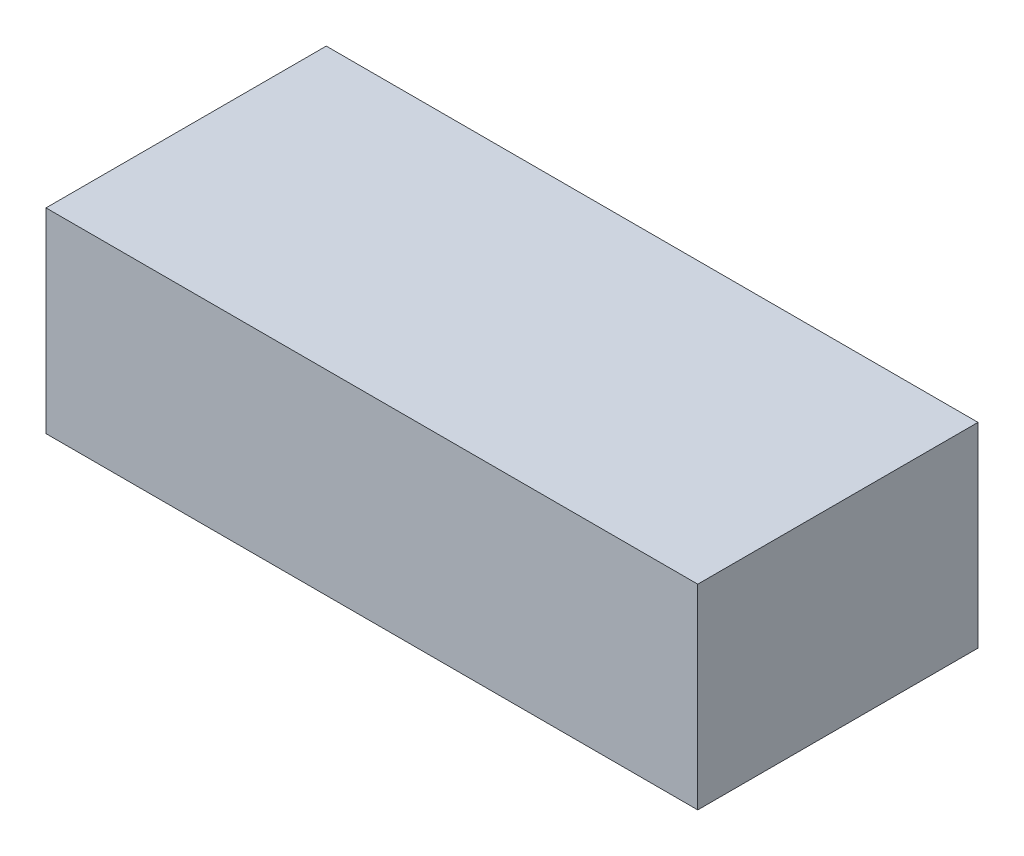
ISO-10303-21;
HEADER;
FILE_DESCRIPTION(('STEP AP214'),'2;1');
FILE_NAME('part.step','',(''),(''),'','','');
FILE_SCHEMA(('AUTOMOTIVE_DESIGN { 1 0 10303 214 1 1 1 1 }'));
ENDSEC;
DATA;
#1=APPLICATION_CONTEXT('core data for automotive mechanical design processes');
#2=APPLICATION_PROTOCOL_DEFINITION('international standard','automotive_design',2000,#1);
#3=PRODUCT_CONTEXT('',#1,'mechanical');
#4=PRODUCT('Part','Part','',(#3));
#5=PRODUCT_RELATED_PRODUCT_CATEGORY('part','',(#4));
#6=PRODUCT_DEFINITION_FORMATION('','',#4);
#7=PRODUCT_DEFINITION_CONTEXT('part definition',#1,'design');
#8=PRODUCT_DEFINITION('design','',#6,#7);
#9=PRODUCT_DEFINITION_SHAPE('','',#8);
#10=(LENGTH_UNIT() NAMED_UNIT(*) SI_UNIT(.MILLI.,.METRE.));
#11=(NAMED_UNIT(*) PLANE_ANGLE_UNIT() SI_UNIT($,.RADIAN.));
#12=(NAMED_UNIT(*) SI_UNIT($,.STERADIAN.) SOLID_ANGLE_UNIT());
#13=UNCERTAINTY_MEASURE_WITH_UNIT(LENGTH_MEASURE(1.E-05),#10,'distance_accuracy_value','');
#14=(GEOMETRIC_REPRESENTATION_CONTEXT(3) GLOBAL_UNCERTAINTY_ASSIGNED_CONTEXT((#13)) GLOBAL_UNIT_ASSIGNED_CONTEXT((#10,
#11,#12)) REPRESENTATION_CONTEXT('',''));
#15=CARTESIAN_POINT('',(0.,0.,0.));
#16=DIRECTION('',(0.,0.,1.));
#17=DIRECTION('',(1.,0.,0.));
#18=AXIS2_PLACEMENT_3D('',#15,#16,#17);
#19=CARTESIAN_POINT('',(-1.27,0.381,0.));
#20=DIRECTION('',(0.,1.,0.));
#21=DIRECTION('',(0.,0.,1.));
#22=AXIS2_PLACEMENT_3D('',#19,#20,#21);
#23=PLANE('',#22);
#24=DIRECTION('',(0.,0.,-1.));
#25=VECTOR('',#24,1.);
#26=CARTESIAN_POINT('',(1.27,0.381,0.));
#27=LINE('',#26,#25);
#28=CARTESIAN_POINT('',(1.27,0.381,0.));
#29=VERTEX_POINT('',#28);
#30=CARTESIAN_POINT('',(1.27,0.381,1.0922));
#31=VERTEX_POINT('',#30);
#32=EDGE_CURVE('E19',#29,#31,#27,.F.);
#33=ORIENTED_EDGE('',*,*,#32,.F.);
#34=DIRECTION('',(1.,0.,0.));
#35=VECTOR('',#34,1.);
#36=CARTESIAN_POINT('',(1.27,0.381,0.));
#37=LINE('',#36,#35);
#38=CARTESIAN_POINT('',(-1.27,0.381,0.));
#39=VERTEX_POINT('',#38);
#40=EDGE_CURVE('E79',#29,#39,#37,.F.);
#41=ORIENTED_EDGE('',*,*,#40,.T.);
#42=DIRECTION('',(0.,0.,1.));
#43=VECTOR('',#42,1.);
#44=CARTESIAN_POINT('',(-1.27,0.381,0.));
#45=LINE('',#44,#43);
#46=CARTESIAN_POINT('',(-1.27,0.381,1.0922));
#47=VERTEX_POINT('',#46);
#48=EDGE_CURVE('E67',#47,#39,#45,.F.);
#49=ORIENTED_EDGE('',*,*,#48,.F.);
#50=DIRECTION('',(1.,0.,0.));
#51=VECTOR('',#50,1.);
#52=CARTESIAN_POINT('',(1.27,0.381,1.0922));
#53=LINE('',#52,#51);
#54=EDGE_CURVE('E55',#31,#47,#53,.F.);
#55=ORIENTED_EDGE('',*,*,#54,.F.);
#56=EDGE_LOOP('',(#33,#41,#49,#55));
#57=FACE_BOUND('',#56,.T.);
#58=ADVANCED_FACE('F16',(#57),#23,.T.);
#59=CARTESIAN_POINT('',(1.27,0.381,0.));
#60=DIRECTION('',(1.,0.,0.));
#61=DIRECTION('',(0.,0.,-1.));
#62=AXIS2_PLACEMENT_3D('',#59,#60,#61);
#63=PLANE('',#62);
#64=DIRECTION('',(0.,0.,-1.));
#65=VECTOR('',#64,1.);
#66=CARTESIAN_POINT('',(1.27,-0.381,0.));
#67=LINE('',#66,#65);
#68=CARTESIAN_POINT('',(1.27,-0.381,0.));
#69=VERTEX_POINT('',#68);
#70=CARTESIAN_POINT('',(1.27,-0.381,1.0922));
#71=VERTEX_POINT('',#70);
#72=EDGE_CURVE('E82',#69,#71,#67,.F.);
#73=ORIENTED_EDGE('',*,*,#72,.F.);
#74=DIRECTION('',(0.,1.,0.));
#75=VECTOR('',#74,1.);
#76=CARTESIAN_POINT('',(1.27,-0.381,0.));
#77=LINE('',#76,#75);
#78=EDGE_CURVE('E64',#69,#29,#77,.T.);
#79=ORIENTED_EDGE('',*,*,#78,.T.);
#80=ORIENTED_EDGE('',*,*,#32,.T.);
#81=DIRECTION('',(0.,1.,0.));
#82=VECTOR('',#81,1.);
#83=CARTESIAN_POINT('',(1.27,-0.381,1.0922));
#84=LINE('',#83,#82);
#85=EDGE_CURVE('E61',#71,#31,#84,.T.);
#86=ORIENTED_EDGE('',*,*,#85,.F.);
#87=EDGE_LOOP('',(#73,#79,#80,#86));
#88=FACE_BOUND('',#87,.T.);
#89=ADVANCED_FACE('F60',(#88),#63,.T.);
#90=CARTESIAN_POINT('',(1.27,-0.381,1.0922));
#91=DIRECTION('',(0.,0.,1.));
#92=DIRECTION('',(1.,0.,0.));
#93=AXIS2_PLACEMENT_3D('',#90,#91,#92);
#94=PLANE('',#93);
#95=DIRECTION('',(0.,1.,0.));
#96=VECTOR('',#95,1.);
#97=CARTESIAN_POINT('',(-1.27,-0.381,1.0922));
#98=LINE('',#97,#96);
#99=CARTESIAN_POINT('',(-1.27,-0.381,1.0922));
#100=VERTEX_POINT('',#99);
#101=EDGE_CURVE('E69',#100,#47,#98,.T.);
#102=ORIENTED_EDGE('',*,*,#101,.F.);
#103=DIRECTION('',(1.,0.,0.));
#104=VECTOR('',#103,1.);
#105=CARTESIAN_POINT('',(1.27,-0.381,1.0922));
#106=LINE('',#105,#104);
#107=EDGE_CURVE('E73',#71,#100,#106,.F.);
#108=ORIENTED_EDGE('',*,*,#107,.F.);
#109=ORIENTED_EDGE('',*,*,#85,.T.);
#110=ORIENTED_EDGE('',*,*,#54,.T.);
#111=EDGE_LOOP('',(#102,#108,#109,#110));
#112=FACE_BOUND('',#111,.T.);
#113=ADVANCED_FACE('F71',(#112),#94,.T.);
#114=CARTESIAN_POINT('',(-1.27,-0.381,0.));
#115=DIRECTION('',(-1.,0.,0.));
#116=DIRECTION('',(0.,0.,1.));
#117=AXIS2_PLACEMENT_3D('',#114,#115,#116);
#118=PLANE('',#117);
#119=ORIENTED_EDGE('',*,*,#48,.T.);
#120=DIRECTION('',(0.,1.,0.));
#121=VECTOR('',#120,1.);
#122=CARTESIAN_POINT('',(-1.27,-0.381,0.));
#123=LINE('',#122,#121);
#124=CARTESIAN_POINT('',(-1.27,-0.381,0.));
#125=VERTEX_POINT('',#124);
#126=EDGE_CURVE('E34',#39,#125,#123,.F.);
#127=ORIENTED_EDGE('',*,*,#126,.T.);
#128=DIRECTION('',(0.,0.,-1.));
#129=VECTOR('',#128,1.);
#130=CARTESIAN_POINT('',(-1.27,-0.381,0.));
#131=LINE('',#130,#129);
#132=EDGE_CURVE('E25',#100,#125,#131,.T.);
#133=ORIENTED_EDGE('',*,*,#132,.F.);
#134=ORIENTED_EDGE('',*,*,#101,.T.);
#135=EDGE_LOOP('',(#119,#127,#133,#134));
#136=FACE_BOUND('',#135,.T.);
#137=ADVANCED_FACE('F88',(#136),#118,.T.);
#138=CARTESIAN_POINT('',(1.27,-0.381,0.));
#139=DIRECTION('',(0.,0.,1.));
#140=DIRECTION('',(1.,0.,0.));
#141=AXIS2_PLACEMENT_3D('',#138,#139,#140);
#142=PLANE('',#141);
#143=ORIENTED_EDGE('',*,*,#126,.F.);
#144=ORIENTED_EDGE('',*,*,#40,.F.);
#145=ORIENTED_EDGE('',*,*,#78,.F.);
#146=DIRECTION('',(1.,0.,0.));
#147=VECTOR('',#146,1.);
#148=CARTESIAN_POINT('',(1.27,-0.381,0.));
#149=LINE('',#148,#147);
#150=EDGE_CURVE('E11',#125,#69,#149,.T.);
#151=ORIENTED_EDGE('',*,*,#150,.F.);
#152=EDGE_LOOP('',(#143,#144,#145,#151));
#153=FACE_BOUND('',#152,.T.);
#154=ADVANCED_FACE('F90',(#153),#142,.F.);
#155=CARTESIAN_POINT('',(1.27,-0.381,0.));
#156=DIRECTION('',(0.,-1.,0.));
#157=DIRECTION('',(0.,0.,-1.));
#158=AXIS2_PLACEMENT_3D('',#155,#156,#157);
#159=PLANE('',#158);
#160=ORIENTED_EDGE('',*,*,#132,.T.);
#161=ORIENTED_EDGE('',*,*,#150,.T.);
#162=ORIENTED_EDGE('',*,*,#72,.T.);
#163=ORIENTED_EDGE('',*,*,#107,.T.);
#164=EDGE_LOOP('',(#160,#161,#162,#163));
#165=FACE_BOUND('',#164,.T.);
#166=ADVANCED_FACE('F87',(#165),#159,.T.);
#167=CLOSED_SHELL('',(#58,#89,#113,#137,#154,#166));
#168=MANIFOLD_SOLID_BREP('B1',#167);
#169=ADVANCED_BREP_SHAPE_REPRESENTATION('',(#18,#168),#14);
#170=SHAPE_DEFINITION_REPRESENTATION(#9,#169);
ENDSEC;
END-ISO-10303-21;
